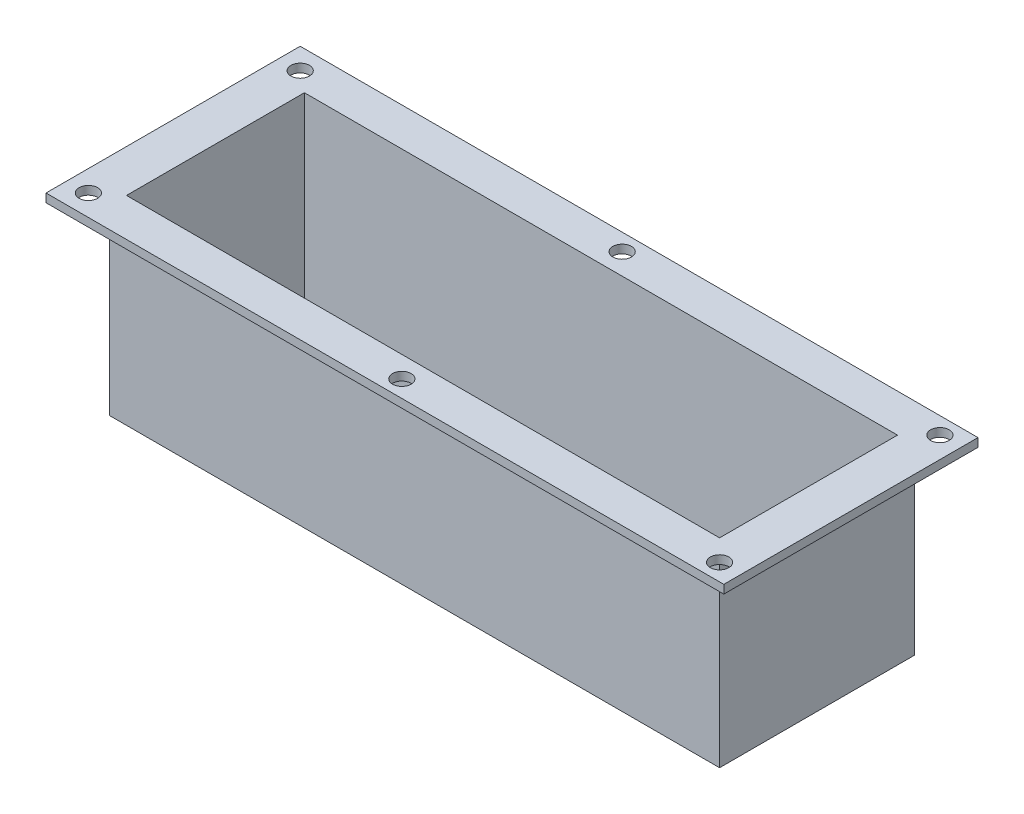
ISO-10303-21;
HEADER;
FILE_DESCRIPTION(('STEP AP214'),'2;1');
FILE_NAME('part.step','',(''),(''),'','','');
FILE_SCHEMA(('AUTOMOTIVE_DESIGN { 1 0 10303 214 1 1 1 1 }'));
ENDSEC;
DATA;
#1=APPLICATION_CONTEXT('core data for automotive mechanical design processes');
#2=APPLICATION_PROTOCOL_DEFINITION('international standard','automotive_design',2000,#1);
#3=PRODUCT_CONTEXT('',#1,'mechanical');
#4=PRODUCT('Part','Part','',(#3));
#5=PRODUCT_RELATED_PRODUCT_CATEGORY('part','',(#4));
#6=PRODUCT_DEFINITION_FORMATION('','',#4);
#7=PRODUCT_DEFINITION_CONTEXT('part definition',#1,'design');
#8=PRODUCT_DEFINITION('design','',#6,#7);
#9=PRODUCT_DEFINITION_SHAPE('','',#8);
#10=(LENGTH_UNIT() NAMED_UNIT(*) SI_UNIT(.MILLI.,.METRE.));
#11=(NAMED_UNIT(*) PLANE_ANGLE_UNIT() SI_UNIT($,.RADIAN.));
#12=(NAMED_UNIT(*) SI_UNIT($,.STERADIAN.) SOLID_ANGLE_UNIT());
#13=UNCERTAINTY_MEASURE_WITH_UNIT(LENGTH_MEASURE(1.E-05),#10,'distance_accuracy_value','');
#14=(GEOMETRIC_REPRESENTATION_CONTEXT(3) GLOBAL_UNCERTAINTY_ASSIGNED_CONTEXT((#13)) GLOBAL_UNIT_ASSIGNED_CONTEXT((#10,
#11,#12)) REPRESENTATION_CONTEXT('',''));
#15=CARTESIAN_POINT('',(0.,0.,0.));
#16=DIRECTION('',(0.,0.,1.));
#17=DIRECTION('',(1.,0.,0.));
#18=AXIS2_PLACEMENT_3D('',#15,#16,#17);
#19=CARTESIAN_POINT('',(91.44,-57.15,-29.21));
#20=DIRECTION('',(1.,0.,0.));
#21=DIRECTION('',(0.,0.,-1.));
#22=AXIS2_PLACEMENT_3D('',#19,#20,#21);
#23=PLANE('',#22);
#24=DIRECTION('',(0.,0.,-1.));
#25=VECTOR('',#24,1.);
#26=CARTESIAN_POINT('',(91.44,-2.54,-29.21));
#27=LINE('',#26,#25);
#28=CARTESIAN_POINT('',(91.44,-2.54,29.21));
#29=VERTEX_POINT('',#28);
#30=CARTESIAN_POINT('',(91.44,-2.54,-29.21));
#31=VERTEX_POINT('',#30);
#32=EDGE_CURVE('E65',#29,#31,#27,.T.);
#33=ORIENTED_EDGE('',*,*,#32,.F.);
#34=DIRECTION('',(0.,1.,0.));
#35=VECTOR('',#34,1.);
#36=CARTESIAN_POINT('',(91.44,-57.15,29.21));
#37=LINE('',#36,#35);
#38=CARTESIAN_POINT('',(91.44,-57.15,29.21));
#39=VERTEX_POINT('',#38);
#40=EDGE_CURVE('E50',#39,#29,#37,.T.);
#41=ORIENTED_EDGE('',*,*,#40,.F.);
#42=DIRECTION('',(0.,0.,-1.));
#43=VECTOR('',#42,1.);
#44=CARTESIAN_POINT('',(91.44,-57.15,-29.21));
#45=LINE('',#44,#43);
#46=CARTESIAN_POINT('',(91.44,-57.15,-29.21));
#47=VERTEX_POINT('',#46);
#48=EDGE_CURVE('E212',#39,#47,#45,.T.);
#49=ORIENTED_EDGE('',*,*,#48,.T.);
#50=DIRECTION('',(0.,1.,0.));
#51=VECTOR('',#50,1.);
#52=CARTESIAN_POINT('',(91.44,-57.15,-29.21));
#53=LINE('',#52,#51);
#54=EDGE_CURVE('E224',#47,#31,#53,.T.);
#55=ORIENTED_EDGE('',*,*,#54,.T.);
#56=EDGE_LOOP('',(#33,#41,#49,#55));
#57=FACE_BOUND('',#56,.T.);
#58=ADVANCED_FACE('F43',(#57),#23,.T.);
#59=CARTESIAN_POINT('',(-91.44,-57.15,29.21));
#60=DIRECTION('',(0.,0.,1.));
#61=DIRECTION('',(1.,0.,0.));
#62=AXIS2_PLACEMENT_3D('',#59,#60,#61);
#63=PLANE('',#62);
#64=DIRECTION('',(1.,0.,0.));
#65=VECTOR('',#64,1.);
#66=CARTESIAN_POINT('',(-91.44,-2.54,29.21));
#67=LINE('',#66,#65);
#68=CARTESIAN_POINT('',(-91.44,-2.54,29.21));
#69=VERTEX_POINT('',#68);
#70=EDGE_CURVE('E208',#69,#29,#67,.T.);
#71=ORIENTED_EDGE('',*,*,#70,.F.);
#72=DIRECTION('',(0.,1.,0.));
#73=VECTOR('',#72,1.);
#74=CARTESIAN_POINT('',(-91.44,-57.15,29.21));
#75=LINE('',#74,#73);
#76=CARTESIAN_POINT('',(-91.44,-57.15,29.21));
#77=VERTEX_POINT('',#76);
#78=EDGE_CURVE('E226',#77,#69,#75,.T.);
#79=ORIENTED_EDGE('',*,*,#78,.F.);
#80=DIRECTION('',(1.,0.,0.));
#81=VECTOR('',#80,1.);
#82=CARTESIAN_POINT('',(-91.44,-57.15,29.21));
#83=LINE('',#82,#81);
#84=EDGE_CURVE('E221',#77,#39,#83,.T.);
#85=ORIENTED_EDGE('',*,*,#84,.T.);
#86=ORIENTED_EDGE('',*,*,#40,.T.);
#87=EDGE_LOOP('',(#71,#79,#85,#86));
#88=FACE_BOUND('',#87,.T.);
#89=ADVANCED_FACE('F238',(#88),#63,.T.);
#90=CARTESIAN_POINT('',(-91.44,-57.15,-29.21));
#91=DIRECTION('',(-1.,0.,0.));
#92=DIRECTION('',(0.,0.,1.));
#93=AXIS2_PLACEMENT_3D('',#90,#91,#92);
#94=PLANE('',#93);
#95=DIRECTION('',(0.,0.,1.));
#96=VECTOR('',#95,1.);
#97=CARTESIAN_POINT('',(-91.44,-2.54,-29.21));
#98=LINE('',#97,#96);
#99=CARTESIAN_POINT('',(-91.44,-2.54,-29.21));
#100=VERTEX_POINT('',#99);
#101=EDGE_CURVE('E200',#100,#69,#98,.T.);
#102=ORIENTED_EDGE('',*,*,#101,.F.);
#103=DIRECTION('',(0.,1.,0.));
#104=VECTOR('',#103,1.);
#105=CARTESIAN_POINT('',(-91.44,-57.15,-29.21));
#106=LINE('',#105,#104);
#107=CARTESIAN_POINT('',(-91.44,-57.15,-29.21));
#108=VERTEX_POINT('',#107);
#109=EDGE_CURVE('E229',#108,#100,#106,.T.);
#110=ORIENTED_EDGE('',*,*,#109,.F.);
#111=DIRECTION('',(0.,0.,1.));
#112=VECTOR('',#111,1.);
#113=CARTESIAN_POINT('',(-91.44,-57.15,-29.21));
#114=LINE('',#113,#112);
#115=EDGE_CURVE('E218',#108,#77,#114,.T.);
#116=ORIENTED_EDGE('',*,*,#115,.T.);
#117=ORIENTED_EDGE('',*,*,#78,.T.);
#118=EDGE_LOOP('',(#102,#110,#116,#117));
#119=FACE_BOUND('',#118,.T.);
#120=ADVANCED_FACE('F240',(#119),#94,.T.);
#121=CARTESIAN_POINT('',(-91.44,-57.15,-29.21));
#122=DIRECTION('',(0.,0.,-1.));
#123=DIRECTION('',(-1.,0.,0.));
#124=AXIS2_PLACEMENT_3D('',#121,#122,#123);
#125=PLANE('',#124);
#126=DIRECTION('',(-1.,0.,0.));
#127=VECTOR('',#126,1.);
#128=CARTESIAN_POINT('',(-91.44,-2.54,-29.21));
#129=LINE('',#128,#127);
#130=EDGE_CURVE('E11',#31,#100,#129,.T.);
#131=ORIENTED_EDGE('',*,*,#130,.F.);
#132=ORIENTED_EDGE('',*,*,#54,.F.);
#133=DIRECTION('',(-1.,0.,0.));
#134=VECTOR('',#133,1.);
#135=CARTESIAN_POINT('',(-91.44,-57.15,-29.21));
#136=LINE('',#135,#134);
#137=EDGE_CURVE('E215',#47,#108,#136,.T.);
#138=ORIENTED_EDGE('',*,*,#137,.T.);
#139=ORIENTED_EDGE('',*,*,#109,.T.);
#140=EDGE_LOOP('',(#131,#132,#138,#139));
#141=FACE_BOUND('',#140,.T.);
#142=ADVANCED_FACE('F245',(#141),#125,.T.);
#143=CARTESIAN_POINT('',(0.,-57.15,0.));
#144=DIRECTION('',(0.,1.,0.));
#145=DIRECTION('',(0.,0.,1.));
#146=AXIS2_PLACEMENT_3D('',#143,#144,#145);
#147=PLANE('',#146);
#148=CARTESIAN_POINT('',(-63.5,-57.15,-12.7));
#149=DIRECTION('',(0.,1.,0.));
#150=DIRECTION('',(0.,0.,1.));
#151=AXIS2_PLACEMENT_3D('',#148,#149,#150);
#152=CIRCLE('',#151,3.175);
#153=CARTESIAN_POINT('',(-63.5,-57.15,-9.52500000000001));
#154=VERTEX_POINT('',#153);
#155=EDGE_CURVE('E344',#154,#154,#152,.T.);
#156=ORIENTED_EDGE('',*,*,#155,.T.);
#157=EDGE_LOOP('',(#156));
#158=FACE_BOUND('',#157,.T.);
#159=CARTESIAN_POINT('',(-50.7999999999998,-57.15,-1.38777878078145E-13));
#160=DIRECTION('',(0.,1.,0.));
#161=DIRECTION('',(0.,0.,1.));
#162=AXIS2_PLACEMENT_3D('',#159,#160,#161);
#163=CIRCLE('',#162,3.175);
#164=CARTESIAN_POINT('',(-50.7999999999998,-57.15,3.17499999999986));
#165=VERTEX_POINT('',#164);
#166=EDGE_CURVE('E353',#165,#165,#163,.T.);
#167=ORIENTED_EDGE('',*,*,#166,.T.);
#168=EDGE_LOOP('',(#167));
#169=FACE_BOUND('',#168,.T.);
#170=CARTESIAN_POINT('',(-63.4999999999997,-57.15,12.7));
#171=DIRECTION('',(0.,1.,0.));
#172=DIRECTION('',(0.,0.,1.));
#173=AXIS2_PLACEMENT_3D('',#170,#171,#172);
#174=CIRCLE('',#173,3.175);
#175=CARTESIAN_POINT('',(-63.4999999999997,-57.15,15.875));
#176=VERTEX_POINT('',#175);
#177=EDGE_CURVE('E361',#176,#176,#174,.T.);
#178=ORIENTED_EDGE('',*,*,#177,.T.);
#179=EDGE_LOOP('',(#178));
#180=FACE_BOUND('',#179,.T.);
#181=CARTESIAN_POINT('',(-76.1999999999998,-57.15,0.));
#182=DIRECTION('',(0.,1.,0.));
#183=DIRECTION('',(0.,0.,1.));
#184=AXIS2_PLACEMENT_3D('',#181,#182,#183);
#185=CIRCLE('',#184,3.175);
#186=CARTESIAN_POINT('',(-76.1999999999998,-57.15,3.17500000000004));
#187=VERTEX_POINT('',#186);
#188=EDGE_CURVE('E367',#187,#187,#185,.T.);
#189=ORIENTED_EDGE('',*,*,#188,.T.);
#190=EDGE_LOOP('',(#189));
#191=FACE_BOUND('',#190,.T.);
#192=ORIENTED_EDGE('',*,*,#48,.F.);
#193=ORIENTED_EDGE('',*,*,#84,.F.);
#194=ORIENTED_EDGE('',*,*,#115,.F.);
#195=ORIENTED_EDGE('',*,*,#137,.F.);
#196=EDGE_LOOP('',(#192,#193,#194,#195));
#197=FACE_BOUND('',#196,.T.);
#198=ADVANCED_FACE('F244',(#158,#169,#180,#191,#197),#147,.F.);
#199=CARTESIAN_POINT('',(101.6,-2.54,38.1));
#200=DIRECTION('',(1.,0.,0.));
#201=DIRECTION('',(0.,0.,-1.));
#202=AXIS2_PLACEMENT_3D('',#199,#200,#201);
#203=PLANE('',#202);
#204=DIRECTION('',(0.,0.,-1.));
#205=VECTOR('',#204,1.);
#206=CARTESIAN_POINT('',(101.6,0.,38.1));
#207=LINE('',#206,#205);
#208=CARTESIAN_POINT('',(101.6,0.,38.1));
#209=VERTEX_POINT('',#208);
#210=CARTESIAN_POINT('',(101.6,0.,-38.1));
#211=VERTEX_POINT('',#210);
#212=EDGE_CURVE('E170',#209,#211,#207,.T.);
#213=ORIENTED_EDGE('',*,*,#212,.F.);
#214=DIRECTION('',(0.,1.,0.));
#215=VECTOR('',#214,1.);
#216=CARTESIAN_POINT('',(101.6,-2.54,38.1));
#217=LINE('',#216,#215);
#218=CARTESIAN_POINT('',(101.6,-2.54,38.1));
#219=VERTEX_POINT('',#218);
#220=EDGE_CURVE('E198',#219,#209,#217,.T.);
#221=ORIENTED_EDGE('',*,*,#220,.F.);
#222=DIRECTION('',(0.,0.,-1.));
#223=VECTOR('',#222,1.);
#224=CARTESIAN_POINT('',(101.6,-2.54,38.1));
#225=LINE('',#224,#223);
#226=CARTESIAN_POINT('',(101.6,-2.54,-38.1));
#227=VERTEX_POINT('',#226);
#228=EDGE_CURVE('E174',#219,#227,#225,.T.);
#229=ORIENTED_EDGE('',*,*,#228,.T.);
#230=DIRECTION('',(0.,1.,0.));
#231=VECTOR('',#230,1.);
#232=CARTESIAN_POINT('',(101.6,-2.54,-38.1));
#233=LINE('',#232,#231);
#234=EDGE_CURVE('E187',#227,#211,#233,.T.);
#235=ORIENTED_EDGE('',*,*,#234,.T.);
#236=EDGE_LOOP('',(#213,#221,#229,#235));
#237=FACE_BOUND('',#236,.T.);
#238=ADVANCED_FACE('F252',(#237),#203,.T.);
#239=CARTESIAN_POINT('',(-101.6,-2.54,38.1));
#240=DIRECTION('',(0.,0.,1.));
#241=DIRECTION('',(1.,0.,0.));
#242=AXIS2_PLACEMENT_3D('',#239,#240,#241);
#243=PLANE('',#242);
#244=DIRECTION('',(1.,0.,0.));
#245=VECTOR('',#244,1.);
#246=CARTESIAN_POINT('',(-101.6,0.,38.1));
#247=LINE('',#246,#245);
#248=CARTESIAN_POINT('',(-101.6,0.,38.1));
#249=VERTEX_POINT('',#248);
#250=EDGE_CURVE('E178',#249,#209,#247,.T.);
#251=ORIENTED_EDGE('',*,*,#250,.F.);
#252=DIRECTION('',(0.,1.,0.));
#253=VECTOR('',#252,1.);
#254=CARTESIAN_POINT('',(-101.6,-2.54,38.1));
#255=LINE('',#254,#253);
#256=CARTESIAN_POINT('',(-101.6,-2.54,38.1));
#257=VERTEX_POINT('',#256);
#258=EDGE_CURVE('E201',#257,#249,#255,.T.);
#259=ORIENTED_EDGE('',*,*,#258,.F.);
#260=DIRECTION('',(1.,0.,0.));
#261=VECTOR('',#260,1.);
#262=CARTESIAN_POINT('',(-101.6,-2.54,38.1));
#263=LINE('',#262,#261);
#264=EDGE_CURVE('E184',#257,#219,#263,.T.);
#265=ORIENTED_EDGE('',*,*,#264,.T.);
#266=ORIENTED_EDGE('',*,*,#220,.T.);
#267=EDGE_LOOP('',(#251,#259,#265,#266));
#268=FACE_BOUND('',#267,.T.);
#269=ADVANCED_FACE('F269',(#268),#243,.T.);
#270=CARTESIAN_POINT('',(-101.6,-2.54,38.1));
#271=DIRECTION('',(-1.,0.,0.));
#272=DIRECTION('',(0.,0.,1.));
#273=AXIS2_PLACEMENT_3D('',#270,#271,#272);
#274=PLANE('',#273);
#275=DIRECTION('',(0.,0.,1.));
#276=VECTOR('',#275,1.);
#277=CARTESIAN_POINT('',(-101.6,0.,38.1));
#278=LINE('',#277,#276);
#279=CARTESIAN_POINT('',(-101.6,0.,-38.1));
#280=VERTEX_POINT('',#279);
#281=EDGE_CURVE('E193',#280,#249,#278,.T.);
#282=ORIENTED_EDGE('',*,*,#281,.F.);
#283=DIRECTION('',(0.,1.,0.));
#284=VECTOR('',#283,1.);
#285=CARTESIAN_POINT('',(-101.6,-2.54,-38.1));
#286=LINE('',#285,#284);
#287=CARTESIAN_POINT('',(-101.6,-2.54,-38.1));
#288=VERTEX_POINT('',#287);
#289=EDGE_CURVE('E203',#288,#280,#286,.T.);
#290=ORIENTED_EDGE('',*,*,#289,.F.);
#291=DIRECTION('',(0.,0.,1.));
#292=VECTOR('',#291,1.);
#293=CARTESIAN_POINT('',(-101.6,-2.54,38.1));
#294=LINE('',#293,#292);
#295=EDGE_CURVE('E181',#288,#257,#294,.T.);
#296=ORIENTED_EDGE('',*,*,#295,.T.);
#297=ORIENTED_EDGE('',*,*,#258,.T.);
#298=EDGE_LOOP('',(#282,#290,#296,#297));
#299=FACE_BOUND('',#298,.T.);
#300=ADVANCED_FACE('F274',(#299),#274,.T.);
#301=CARTESIAN_POINT('',(-101.6,-2.54,-38.1));
#302=DIRECTION('',(0.,0.,-1.));
#303=DIRECTION('',(-1.,0.,0.));
#304=AXIS2_PLACEMENT_3D('',#301,#302,#303);
#305=PLANE('',#304);
#306=DIRECTION('',(-1.,0.,0.));
#307=VECTOR('',#306,1.);
#308=CARTESIAN_POINT('',(-101.6,0.,-38.1));
#309=LINE('',#308,#307);
#310=EDGE_CURVE('E190',#211,#280,#309,.T.);
#311=ORIENTED_EDGE('',*,*,#310,.F.);
#312=ORIENTED_EDGE('',*,*,#234,.F.);
#313=DIRECTION('',(-1.,0.,0.));
#314=VECTOR('',#313,1.);
#315=CARTESIAN_POINT('',(-101.6,-2.54,-38.1));
#316=LINE('',#315,#314);
#317=EDGE_CURVE('E177',#227,#288,#316,.T.);
#318=ORIENTED_EDGE('',*,*,#317,.T.);
#319=ORIENTED_EDGE('',*,*,#289,.T.);
#320=EDGE_LOOP('',(#311,#312,#318,#319));
#321=FACE_BOUND('',#320,.T.);
#322=ADVANCED_FACE('F271',(#321),#305,.T.);
#323=CARTESIAN_POINT('',(0.,-2.54,0.));
#324=DIRECTION('',(0.,-1.,0.));
#325=DIRECTION('',(0.,0.,-1.));
#326=AXIS2_PLACEMENT_3D('',#323,#324,#325);
#327=PLANE('',#326);
#328=CARTESIAN_POINT('',(-95.25,-2.54,31.75));
#329=DIRECTION('',(0.,-1.,0.));
#330=DIRECTION('',(0.,0.,-1.));
#331=AXIS2_PLACEMENT_3D('',#328,#329,#330);
#332=CIRCLE('',#331,2.7813);
#333=CARTESIAN_POINT('',(-95.25,-2.54,28.9687));
#334=VERTEX_POINT('',#333);
#335=EDGE_CURVE('E158',#334,#334,#332,.T.);
#336=ORIENTED_EDGE('',*,*,#335,.F.);
#337=EDGE_LOOP('',(#336));
#338=FACE_BOUND('',#337,.T.);
#339=CARTESIAN_POINT('',(0.,-2.54,33.02));
#340=DIRECTION('',(0.,-1.,0.));
#341=DIRECTION('',(0.,0.,-1.));
#342=AXIS2_PLACEMENT_3D('',#339,#340,#341);
#343=CIRCLE('',#342,2.7813);
#344=CARTESIAN_POINT('',(0.,-2.54,30.2387));
#345=VERTEX_POINT('',#344);
#346=EDGE_CURVE('E398',#345,#345,#343,.T.);
#347=ORIENTED_EDGE('',*,*,#346,.F.);
#348=EDGE_LOOP('',(#347));
#349=FACE_BOUND('',#348,.T.);
#350=CARTESIAN_POINT('',(95.25,-2.54,33.02));
#351=DIRECTION('',(0.,-1.,0.));
#352=DIRECTION('',(0.,0.,-1.));
#353=AXIS2_PLACEMENT_3D('',#350,#351,#352);
#354=CIRCLE('',#353,2.78129999999999);
#355=CARTESIAN_POINT('',(95.25,-2.54,30.2387));
#356=VERTEX_POINT('',#355);
#357=EDGE_CURVE('E396',#356,#356,#354,.T.);
#358=ORIENTED_EDGE('',*,*,#357,.F.);
#359=EDGE_LOOP('',(#358));
#360=FACE_BOUND('',#359,.T.);
#361=CARTESIAN_POINT('',(95.25,-2.54,-33.02));
#362=DIRECTION('',(0.,-1.,0.));
#363=DIRECTION('',(0.,0.,-1.));
#364=AXIS2_PLACEMENT_3D('',#361,#362,#363);
#365=CIRCLE('',#364,2.78129999999999);
#366=CARTESIAN_POINT('',(95.25,-2.54,-35.8013));
#367=VERTEX_POINT('',#366);
#368=EDGE_CURVE('E393',#367,#367,#365,.T.);
#369=ORIENTED_EDGE('',*,*,#368,.F.);
#370=EDGE_LOOP('',(#369));
#371=FACE_BOUND('',#370,.T.);
#372=CARTESIAN_POINT('',(0.,-2.54,-33.02));
#373=DIRECTION('',(0.,-1.,0.));
#374=DIRECTION('',(0.,0.,-1.));
#375=AXIS2_PLACEMENT_3D('',#372,#373,#374);
#376=CIRCLE('',#375,2.7813);
#377=CARTESIAN_POINT('',(0.,-2.54,-35.8013));
#378=VERTEX_POINT('',#377);
#379=EDGE_CURVE('E390',#378,#378,#376,.T.);
#380=ORIENTED_EDGE('',*,*,#379,.F.);
#381=EDGE_LOOP('',(#380));
#382=FACE_BOUND('',#381,.T.);
#383=CARTESIAN_POINT('',(-95.25,-2.54,-31.75));
#384=DIRECTION('',(0.,-1.,0.));
#385=DIRECTION('',(0.,0.,-1.));
#386=AXIS2_PLACEMENT_3D('',#383,#384,#385);
#387=CIRCLE('',#386,2.78129999999999);
#388=CARTESIAN_POINT('',(-95.25,-2.54,-34.5313));
#389=VERTEX_POINT('',#388);
#390=EDGE_CURVE('E387',#389,#389,#387,.T.);
#391=ORIENTED_EDGE('',*,*,#390,.F.);
#392=EDGE_LOOP('',(#391));
#393=FACE_BOUND('',#392,.T.);
#394=ORIENTED_EDGE('',*,*,#70,.T.);
#395=ORIENTED_EDGE('',*,*,#32,.T.);
#396=ORIENTED_EDGE('',*,*,#130,.T.);
#397=ORIENTED_EDGE('',*,*,#101,.T.);
#398=EDGE_LOOP('',(#394,#395,#396,#397));
#399=FACE_BOUND('',#398,.T.);
#400=ORIENTED_EDGE('',*,*,#228,.F.);
#401=ORIENTED_EDGE('',*,*,#264,.F.);
#402=ORIENTED_EDGE('',*,*,#295,.F.);
#403=ORIENTED_EDGE('',*,*,#317,.F.);
#404=EDGE_LOOP('',(#400,#401,#402,#403));
#405=FACE_BOUND('',#404,.T.);
#406=ADVANCED_FACE('F234',(#338,#349,#360,#371,#382,#393,#399,#405),#327,.T.);
#407=CARTESIAN_POINT('',(0.,0.,0.));
#408=DIRECTION('',(0.,1.,0.));
#409=DIRECTION('',(0.,0.,1.));
#410=AXIS2_PLACEMENT_3D('',#407,#408,#409);
#411=PLANE('',#410);
#412=CARTESIAN_POINT('',(-95.25,0.,31.75));
#413=DIRECTION('',(0.,1.,0.));
#414=DIRECTION('',(0.,0.,-1.));
#415=AXIS2_PLACEMENT_3D('',#412,#413,#414);
#416=CIRCLE('',#415,2.7813);
#417=CARTESIAN_POINT('',(-95.25,0.,28.9687));
#418=VERTEX_POINT('',#417);
#419=EDGE_CURVE('E350',#418,#418,#416,.T.);
#420=ORIENTED_EDGE('',*,*,#419,.F.);
#421=EDGE_LOOP('',(#420));
#422=FACE_BOUND('',#421,.T.);
#423=CARTESIAN_POINT('',(0.,0.,33.02));
#424=DIRECTION('',(0.,1.,0.));
#425=DIRECTION('',(0.,0.,-1.));
#426=AXIS2_PLACEMENT_3D('',#423,#424,#425);
#427=CIRCLE('',#426,2.7813);
#428=CARTESIAN_POINT('',(0.,0.,30.2387));
#429=VERTEX_POINT('',#428);
#430=EDGE_CURVE('E380',#429,#429,#427,.T.);
#431=ORIENTED_EDGE('',*,*,#430,.F.);
#432=EDGE_LOOP('',(#431));
#433=FACE_BOUND('',#432,.T.);
#434=CARTESIAN_POINT('',(95.25,0.,33.02));
#435=DIRECTION('',(0.,1.,0.));
#436=DIRECTION('',(0.,0.,-1.));
#437=AXIS2_PLACEMENT_3D('',#434,#435,#436);
#438=CIRCLE('',#437,2.78129999999999);
#439=CARTESIAN_POINT('',(95.25,0.,30.2387));
#440=VERTEX_POINT('',#439);
#441=EDGE_CURVE('E377',#440,#440,#438,.T.);
#442=ORIENTED_EDGE('',*,*,#441,.F.);
#443=EDGE_LOOP('',(#442));
#444=FACE_BOUND('',#443,.T.);
#445=CARTESIAN_POINT('',(95.25,0.,-33.02));
#446=DIRECTION('',(0.,1.,0.));
#447=DIRECTION('',(0.,0.,1.));
#448=AXIS2_PLACEMENT_3D('',#445,#446,#447);
#449=CIRCLE('',#448,2.78129999999999);
#450=CARTESIAN_POINT('',(95.25,0.,-30.2387));
#451=VERTEX_POINT('',#450);
#452=EDGE_CURVE('E374',#451,#451,#449,.T.);
#453=ORIENTED_EDGE('',*,*,#452,.F.);
#454=EDGE_LOOP('',(#453));
#455=FACE_BOUND('',#454,.T.);
#456=CARTESIAN_POINT('',(0.,0.,-33.02));
#457=DIRECTION('',(0.,1.,0.));
#458=DIRECTION('',(0.,0.,1.));
#459=AXIS2_PLACEMENT_3D('',#456,#457,#458);
#460=CIRCLE('',#459,2.7813);
#461=CARTESIAN_POINT('',(0.,0.,-30.2387));
#462=VERTEX_POINT('',#461);
#463=EDGE_CURVE('E370',#462,#462,#460,.T.);
#464=ORIENTED_EDGE('',*,*,#463,.F.);
#465=EDGE_LOOP('',(#464));
#466=FACE_BOUND('',#465,.T.);
#467=CARTESIAN_POINT('',(-95.25,0.,-31.75));
#468=DIRECTION('',(0.,1.,0.));
#469=DIRECTION('',(0.,0.,1.));
#470=AXIS2_PLACEMENT_3D('',#467,#468,#469);
#471=CIRCLE('',#470,2.78129999999999);
#472=CARTESIAN_POINT('',(-95.25,0.,-28.9687));
#473=VERTEX_POINT('',#472);
#474=EDGE_CURVE('E373',#473,#473,#471,.T.);
#475=ORIENTED_EDGE('',*,*,#474,.F.);
#476=EDGE_LOOP('',(#475));
#477=FACE_BOUND('',#476,.T.);
#478=DIRECTION('',(0.,0.,-1.));
#479=VECTOR('',#478,1.);
#480=CARTESIAN_POINT('',(88.9,0.,26.67));
#481=LINE('',#480,#479);
#482=CARTESIAN_POINT('',(88.9,0.,26.67));
#483=VERTEX_POINT('',#482);
#484=CARTESIAN_POINT('',(88.9,0.,-26.67));
#485=VERTEX_POINT('',#484);
#486=EDGE_CURVE('E57',#483,#485,#481,.T.);
#487=ORIENTED_EDGE('',*,*,#486,.F.);
#488=DIRECTION('',(1.,0.,0.));
#489=VECTOR('',#488,1.);
#490=CARTESIAN_POINT('',(-88.9,0.,26.67));
#491=LINE('',#490,#489);
#492=CARTESIAN_POINT('',(-88.9,0.,26.67));
#493=VERTEX_POINT('',#492);
#494=EDGE_CURVE('E152',#493,#483,#491,.T.);
#495=ORIENTED_EDGE('',*,*,#494,.F.);
#496=DIRECTION('',(0.,0.,1.));
#497=VECTOR('',#496,1.);
#498=CARTESIAN_POINT('',(-88.9,0.,26.67));
#499=LINE('',#498,#497);
#500=CARTESIAN_POINT('',(-88.9,0.,-26.67));
#501=VERTEX_POINT('',#500);
#502=EDGE_CURVE('E155',#501,#493,#499,.T.);
#503=ORIENTED_EDGE('',*,*,#502,.F.);
#504=DIRECTION('',(-1.,0.,0.));
#505=VECTOR('',#504,1.);
#506=CARTESIAN_POINT('',(-88.9,0.,-26.67));
#507=LINE('',#506,#505);
#508=EDGE_CURVE('E164',#485,#501,#507,.T.);
#509=ORIENTED_EDGE('',*,*,#508,.F.);
#510=EDGE_LOOP('',(#487,#495,#503,#509));
#511=FACE_BOUND('',#510,.T.);
#512=ORIENTED_EDGE('',*,*,#212,.T.);
#513=ORIENTED_EDGE('',*,*,#310,.T.);
#514=ORIENTED_EDGE('',*,*,#281,.T.);
#515=ORIENTED_EDGE('',*,*,#250,.T.);
#516=EDGE_LOOP('',(#512,#513,#514,#515));
#517=FACE_BOUND('',#516,.T.);
#518=ADVANCED_FACE('F264',(#422,#433,#444,#455,#466,#477,#511,#517),#411,.T.);
#519=CARTESIAN_POINT('',(88.9,-54.61,26.67));
#520=DIRECTION('',(1.,0.,0.));
#521=DIRECTION('',(0.,0.,-1.));
#522=AXIS2_PLACEMENT_3D('',#519,#520,#521);
#523=PLANE('',#522);
#524=ORIENTED_EDGE('',*,*,#486,.T.);
#525=DIRECTION('',(0.,1.,0.));
#526=VECTOR('',#525,1.);
#527=CARTESIAN_POINT('',(88.9,-54.61,-26.67));
#528=LINE('',#527,#526);
#529=CARTESIAN_POINT('',(88.9,-54.61,-26.67));
#530=VERTEX_POINT('',#529);
#531=EDGE_CURVE('E130',#530,#485,#528,.T.);
#532=ORIENTED_EDGE('',*,*,#531,.F.);
#533=DIRECTION('',(0.,0.,-1.));
#534=VECTOR('',#533,1.);
#535=CARTESIAN_POINT('',(88.9,-54.61,26.67));
#536=LINE('',#535,#534);
#537=CARTESIAN_POINT('',(88.9,-54.61,26.67));
#538=VERTEX_POINT('',#537);
#539=EDGE_CURVE('E134',#538,#530,#536,.T.);
#540=ORIENTED_EDGE('',*,*,#539,.F.);
#541=DIRECTION('',(0.,1.,0.));
#542=VECTOR('',#541,1.);
#543=CARTESIAN_POINT('',(88.9,-54.61,26.67));
#544=LINE('',#543,#542);
#545=EDGE_CURVE('E168',#538,#483,#544,.T.);
#546=ORIENTED_EDGE('',*,*,#545,.T.);
#547=EDGE_LOOP('',(#524,#532,#540,#546));
#548=FACE_BOUND('',#547,.T.);
#549=ADVANCED_FACE('F132',(#548),#523,.F.);
#550=CARTESIAN_POINT('',(-88.9,-54.61,26.67));
#551=DIRECTION('',(0.,0.,1.));
#552=DIRECTION('',(1.,0.,0.));
#553=AXIS2_PLACEMENT_3D('',#550,#551,#552);
#554=PLANE('',#553);
#555=ORIENTED_EDGE('',*,*,#494,.T.);
#556=ORIENTED_EDGE('',*,*,#545,.F.);
#557=DIRECTION('',(1.,0.,0.));
#558=VECTOR('',#557,1.);
#559=CARTESIAN_POINT('',(-88.9,-54.61,26.67));
#560=LINE('',#559,#558);
#561=CARTESIAN_POINT('',(-88.9,-54.61,26.67));
#562=VERTEX_POINT('',#561);
#563=EDGE_CURVE('E140',#562,#538,#560,.T.);
#564=ORIENTED_EDGE('',*,*,#563,.F.);
#565=DIRECTION('',(0.,1.,0.));
#566=VECTOR('',#565,1.);
#567=CARTESIAN_POINT('',(-88.9,-54.61,26.67));
#568=LINE('',#567,#566);
#569=EDGE_CURVE('E171',#562,#493,#568,.T.);
#570=ORIENTED_EDGE('',*,*,#569,.T.);
#571=EDGE_LOOP('',(#555,#556,#564,#570));
#572=FACE_BOUND('',#571,.T.);
#573=ADVANCED_FACE('F287',(#572),#554,.F.);
#574=CARTESIAN_POINT('',(-88.9,-54.61,26.67));
#575=DIRECTION('',(-1.,0.,0.));
#576=DIRECTION('',(0.,0.,1.));
#577=AXIS2_PLACEMENT_3D('',#574,#575,#576);
#578=PLANE('',#577);
#579=ORIENTED_EDGE('',*,*,#502,.T.);
#580=ORIENTED_EDGE('',*,*,#569,.F.);
#581=DIRECTION('',(0.,0.,1.));
#582=VECTOR('',#581,1.);
#583=CARTESIAN_POINT('',(-88.9,-54.61,26.67));
#584=LINE('',#583,#582);
#585=CARTESIAN_POINT('',(-88.9,-54.61,-26.67));
#586=VERTEX_POINT('',#585);
#587=EDGE_CURVE('E148',#586,#562,#584,.T.);
#588=ORIENTED_EDGE('',*,*,#587,.F.);
#589=DIRECTION('',(0.,1.,0.));
#590=VECTOR('',#589,1.);
#591=CARTESIAN_POINT('',(-88.9,-54.61,-26.67));
#592=LINE('',#591,#590);
#593=EDGE_CURVE('E139',#586,#501,#592,.T.);
#594=ORIENTED_EDGE('',*,*,#593,.T.);
#595=EDGE_LOOP('',(#579,#580,#588,#594));
#596=FACE_BOUND('',#595,.T.);
#597=ADVANCED_FACE('F290',(#596),#578,.F.);
#598=CARTESIAN_POINT('',(-88.9,-54.61,-26.67));
#599=DIRECTION('',(0.,0.,-1.));
#600=DIRECTION('',(-1.,0.,0.));
#601=AXIS2_PLACEMENT_3D('',#598,#599,#600);
#602=PLANE('',#601);
#603=ORIENTED_EDGE('',*,*,#508,.T.);
#604=ORIENTED_EDGE('',*,*,#593,.F.);
#605=DIRECTION('',(-1.,0.,0.));
#606=VECTOR('',#605,1.);
#607=CARTESIAN_POINT('',(-88.9,-54.61,-26.67));
#608=LINE('',#607,#606);
#609=EDGE_CURVE('E143',#530,#586,#608,.T.);
#610=ORIENTED_EDGE('',*,*,#609,.F.);
#611=ORIENTED_EDGE('',*,*,#531,.T.);
#612=EDGE_LOOP('',(#603,#604,#610,#611));
#613=FACE_BOUND('',#612,.T.);
#614=ADVANCED_FACE('F144',(#613),#602,.F.);
#615=CARTESIAN_POINT('',(0.,-54.61,0.));
#616=DIRECTION('',(0.,-1.,0.));
#617=DIRECTION('',(0.,0.,-1.));
#618=AXIS2_PLACEMENT_3D('',#615,#616,#617);
#619=PLANE('',#618);
#620=CARTESIAN_POINT('',(-63.5,-54.61,-12.7));
#621=DIRECTION('',(0.,1.,0.));
#622=DIRECTION('',(0.,0.,1.));
#623=AXIS2_PLACEMENT_3D('',#620,#621,#622);
#624=CIRCLE('',#623,3.175);
#625=CARTESIAN_POINT('',(-63.5,-54.61,-9.52500000000001));
#626=VERTEX_POINT('',#625);
#627=EDGE_CURVE('E347',#626,#626,#624,.T.);
#628=ORIENTED_EDGE('',*,*,#627,.F.);
#629=EDGE_LOOP('',(#628));
#630=FACE_BOUND('',#629,.T.);
#631=CARTESIAN_POINT('',(-50.7999999999998,-54.61,-1.38777878078145E-13));
#632=DIRECTION('',(0.,1.,0.));
#633=DIRECTION('',(0.,0.,1.));
#634=AXIS2_PLACEMENT_3D('',#631,#632,#633);
#635=CIRCLE('',#634,3.175);
#636=CARTESIAN_POINT('',(-50.7999999999998,-54.61,3.17499999999986));
#637=VERTEX_POINT('',#636);
#638=EDGE_CURVE('E348',#637,#637,#635,.T.);
#639=ORIENTED_EDGE('',*,*,#638,.F.);
#640=EDGE_LOOP('',(#639));
#641=FACE_BOUND('',#640,.T.);
#642=CARTESIAN_POINT('',(-63.4999999999997,-54.61,12.7));
#643=DIRECTION('',(0.,1.,0.));
#644=DIRECTION('',(0.,0.,1.));
#645=AXIS2_PLACEMENT_3D('',#642,#643,#644);
#646=CIRCLE('',#645,3.175);
#647=CARTESIAN_POINT('',(-63.4999999999997,-54.61,15.875));
#648=VERTEX_POINT('',#647);
#649=EDGE_CURVE('E358',#648,#648,#646,.T.);
#650=ORIENTED_EDGE('',*,*,#649,.F.);
#651=EDGE_LOOP('',(#650));
#652=FACE_BOUND('',#651,.T.);
#653=CARTESIAN_POINT('',(-76.1999999999998,-54.61,0.));
#654=DIRECTION('',(0.,1.,0.));
#655=DIRECTION('',(0.,0.,1.));
#656=AXIS2_PLACEMENT_3D('',#653,#654,#655);
#657=CIRCLE('',#656,3.175);
#658=CARTESIAN_POINT('',(-76.1999999999998,-54.61,3.17500000000004));
#659=VERTEX_POINT('',#658);
#660=EDGE_CURVE('E364',#659,#659,#657,.T.);
#661=ORIENTED_EDGE('',*,*,#660,.F.);
#662=EDGE_LOOP('',(#661));
#663=FACE_BOUND('',#662,.T.);
#664=ORIENTED_EDGE('',*,*,#539,.T.);
#665=ORIENTED_EDGE('',*,*,#609,.T.);
#666=ORIENTED_EDGE('',*,*,#587,.T.);
#667=ORIENTED_EDGE('',*,*,#563,.T.);
#668=EDGE_LOOP('',(#664,#665,#666,#667));
#669=FACE_BOUND('',#668,.T.);
#670=ADVANCED_FACE('F150',(#630,#641,#652,#663,#669),#619,.F.);
#671=CARTESIAN_POINT('',(-95.25,-53.34,-31.75));
#672=DIRECTION('',(0.,1.,0.));
#673=DIRECTION('',(0.,0.,1.));
#674=AXIS2_PLACEMENT_3D('',#671,#672,#673);
#675=CYLINDRICAL_SURFACE('',#674,2.78129999999999);
#676=ORIENTED_EDGE('',*,*,#390,.T.);
#677=EDGE_LOOP('',(#676));
#678=FACE_BOUND('',#677,.T.);
#679=ORIENTED_EDGE('',*,*,#474,.T.);
#680=EDGE_LOOP('',(#679));
#681=FACE_BOUND('',#680,.T.);
#682=ADVANCED_FACE('F299',(#678,#681),#675,.F.);
#683=CARTESIAN_POINT('',(0.,-53.34,-33.02));
#684=DIRECTION('',(0.,1.,0.));
#685=DIRECTION('',(0.,0.,1.));
#686=AXIS2_PLACEMENT_3D('',#683,#684,#685);
#687=CYLINDRICAL_SURFACE('',#686,2.7813);
#688=ORIENTED_EDGE('',*,*,#379,.T.);
#689=EDGE_LOOP('',(#688));
#690=FACE_BOUND('',#689,.T.);
#691=ORIENTED_EDGE('',*,*,#463,.T.);
#692=EDGE_LOOP('',(#691));
#693=FACE_BOUND('',#692,.T.);
#694=ADVANCED_FACE('F303',(#690,#693),#687,.F.);
#695=CARTESIAN_POINT('',(95.25,-53.34,-33.02));
#696=DIRECTION('',(0.,1.,0.));
#697=DIRECTION('',(0.,0.,1.));
#698=AXIS2_PLACEMENT_3D('',#695,#696,#697);
#699=CYLINDRICAL_SURFACE('',#698,2.78129999999999);
#700=ORIENTED_EDGE('',*,*,#368,.T.);
#701=EDGE_LOOP('',(#700));
#702=FACE_BOUND('',#701,.T.);
#703=ORIENTED_EDGE('',*,*,#452,.T.);
#704=EDGE_LOOP('',(#703));
#705=FACE_BOUND('',#704,.T.);
#706=ADVANCED_FACE('F317',(#702,#705),#699,.F.);
#707=CARTESIAN_POINT('',(95.25,-53.34,33.02));
#708=DIRECTION('',(0.,1.,0.));
#709=DIRECTION('',(0.,0.,1.));
#710=AXIS2_PLACEMENT_3D('',#707,#708,#709);
#711=CYLINDRICAL_SURFACE('',#710,2.78129999999999);
#712=ORIENTED_EDGE('',*,*,#357,.T.);
#713=EDGE_LOOP('',(#712));
#714=FACE_BOUND('',#713,.T.);
#715=ORIENTED_EDGE('',*,*,#441,.T.);
#716=EDGE_LOOP('',(#715));
#717=FACE_BOUND('',#716,.T.);
#718=ADVANCED_FACE('F313',(#714,#717),#711,.F.);
#719=CARTESIAN_POINT('',(0.,-53.34,33.02));
#720=DIRECTION('',(0.,1.,0.));
#721=DIRECTION('',(0.,0.,1.));
#722=AXIS2_PLACEMENT_3D('',#719,#720,#721);
#723=CYLINDRICAL_SURFACE('',#722,2.7813);
#724=ORIENTED_EDGE('',*,*,#346,.T.);
#725=EDGE_LOOP('',(#724));
#726=FACE_BOUND('',#725,.T.);
#727=ORIENTED_EDGE('',*,*,#430,.T.);
#728=EDGE_LOOP('',(#727));
#729=FACE_BOUND('',#728,.T.);
#730=ADVANCED_FACE('F309',(#726,#729),#723,.F.);
#731=CARTESIAN_POINT('',(-95.25,-53.34,31.75));
#732=DIRECTION('',(0.,1.,0.));
#733=DIRECTION('',(0.,0.,1.));
#734=AXIS2_PLACEMENT_3D('',#731,#732,#733);
#735=CYLINDRICAL_SURFACE('',#734,2.7813);
#736=ORIENTED_EDGE('',*,*,#335,.T.);
#737=EDGE_LOOP('',(#736));
#738=FACE_BOUND('',#737,.T.);
#739=ORIENTED_EDGE('',*,*,#419,.T.);
#740=EDGE_LOOP('',(#739));
#741=FACE_BOUND('',#740,.T.);
#742=ADVANCED_FACE('F305',(#738,#741),#735,.F.);
#743=CARTESIAN_POINT('',(-76.1999999999998,-57.15,0.));
#744=DIRECTION('',(0.,1.,0.));
#745=DIRECTION('',(0.,0.,1.));
#746=AXIS2_PLACEMENT_3D('',#743,#744,#745);
#747=CYLINDRICAL_SURFACE('',#746,3.175);
#748=ORIENTED_EDGE('',*,*,#188,.F.);
#749=EDGE_LOOP('',(#748));
#750=FACE_BOUND('',#749,.T.);
#751=ORIENTED_EDGE('',*,*,#660,.T.);
#752=EDGE_LOOP('',(#751));
#753=FACE_BOUND('',#752,.T.);
#754=ADVANCED_FACE('F308',(#750,#753),#747,.F.);
#755=CARTESIAN_POINT('',(-63.4999999999997,-57.15,12.7));
#756=DIRECTION('',(0.,1.,0.));
#757=DIRECTION('',(0.,0.,1.));
#758=AXIS2_PLACEMENT_3D('',#755,#756,#757);
#759=CYLINDRICAL_SURFACE('',#758,3.175);
#760=ORIENTED_EDGE('',*,*,#177,.F.);
#761=EDGE_LOOP('',(#760));
#762=FACE_BOUND('',#761,.T.);
#763=ORIENTED_EDGE('',*,*,#649,.T.);
#764=EDGE_LOOP('',(#763));
#765=FACE_BOUND('',#764,.T.);
#766=ADVANCED_FACE('F327',(#762,#765),#759,.F.);
#767=CARTESIAN_POINT('',(-50.7999999999998,-57.15,-1.38777878078145E-13));
#768=DIRECTION('',(0.,1.,0.));
#769=DIRECTION('',(0.,0.,1.));
#770=AXIS2_PLACEMENT_3D('',#767,#768,#769);
#771=CYLINDRICAL_SURFACE('',#770,3.175);
#772=ORIENTED_EDGE('',*,*,#166,.F.);
#773=EDGE_LOOP('',(#772));
#774=FACE_BOUND('',#773,.T.);
#775=ORIENTED_EDGE('',*,*,#638,.T.);
#776=EDGE_LOOP('',(#775));
#777=FACE_BOUND('',#776,.T.);
#778=ADVANCED_FACE('F331',(#774,#777),#771,.F.);
#779=CARTESIAN_POINT('',(-63.5,-57.15,-12.7));
#780=DIRECTION('',(0.,1.,0.));
#781=DIRECTION('',(0.,0.,1.));
#782=AXIS2_PLACEMENT_3D('',#779,#780,#781);
#783=CYLINDRICAL_SURFACE('',#782,3.175);
#784=ORIENTED_EDGE('',*,*,#155,.F.);
#785=EDGE_LOOP('',(#784));
#786=FACE_BOUND('',#785,.T.);
#787=ORIENTED_EDGE('',*,*,#627,.T.);
#788=EDGE_LOOP('',(#787));
#789=FACE_BOUND('',#788,.T.);
#790=ADVANCED_FACE('F335',(#786,#789),#783,.F.);
#791=CLOSED_SHELL('',(#58,#89,#120,#142,#198,#238,#269,#300,#322,#406,#518,#549,#573,#597,#614,
#670,#682,#694,#706,#718,#730,#742,#754,#766,#778,#790));
#792=MANIFOLD_SOLID_BREP('B2',#791);
#793=ADVANCED_BREP_SHAPE_REPRESENTATION('',(#18,#792),#14);
#794=SHAPE_DEFINITION_REPRESENTATION(#9,#793);
ENDSEC;
END-ISO-10303-21;
